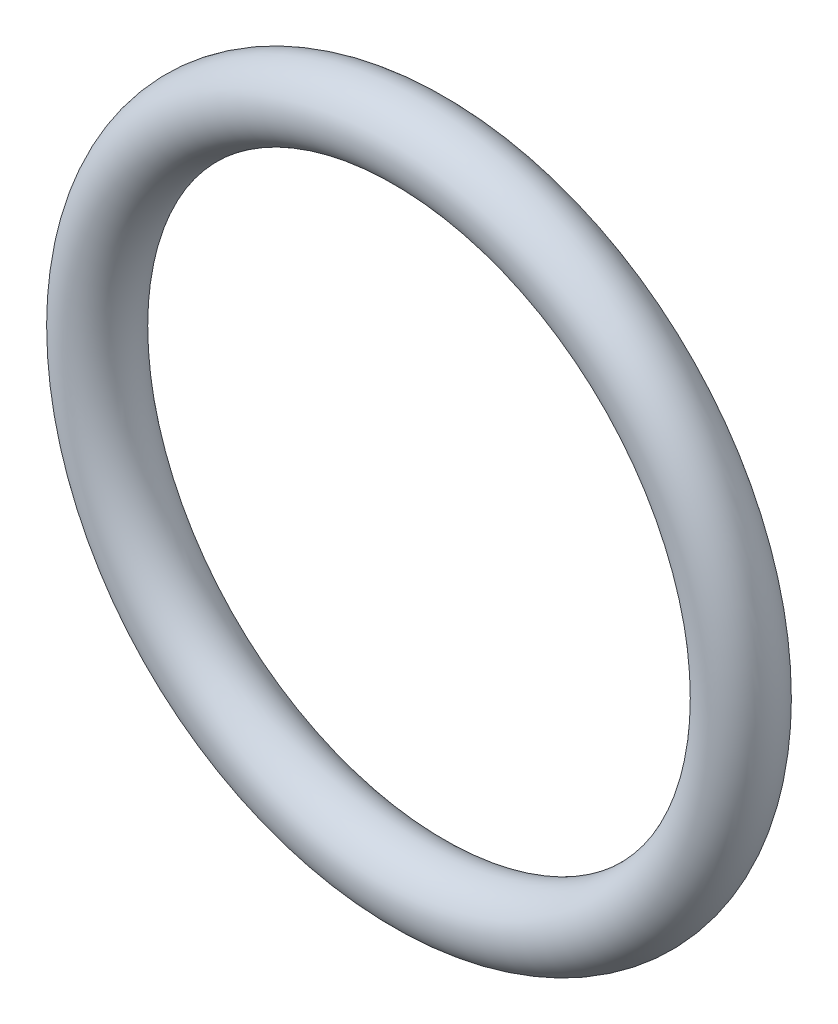
ISO-10303-21;
HEADER;
FILE_DESCRIPTION(('STEP AP214'),'2;1');
FILE_NAME('part.step','',(''),(''),'','','');
FILE_SCHEMA(('AUTOMOTIVE_DESIGN { 1 0 10303 214 1 1 1 1 }'));
ENDSEC;
DATA;
#1=APPLICATION_CONTEXT('core data for automotive mechanical design processes');
#2=APPLICATION_PROTOCOL_DEFINITION('international standard','automotive_design',2000,#1);
#3=PRODUCT_CONTEXT('',#1,'mechanical');
#4=PRODUCT('Part','Part','',(#3));
#5=PRODUCT_RELATED_PRODUCT_CATEGORY('part','',(#4));
#6=PRODUCT_DEFINITION_FORMATION('','',#4);
#7=PRODUCT_DEFINITION_CONTEXT('part definition',#1,'design');
#8=PRODUCT_DEFINITION('design','',#6,#7);
#9=PRODUCT_DEFINITION_SHAPE('','',#8);
#10=(LENGTH_UNIT() NAMED_UNIT(*) SI_UNIT(.MILLI.,.METRE.));
#11=(NAMED_UNIT(*) PLANE_ANGLE_UNIT() SI_UNIT($,.RADIAN.));
#12=(NAMED_UNIT(*) SI_UNIT($,.STERADIAN.) SOLID_ANGLE_UNIT());
#13=UNCERTAINTY_MEASURE_WITH_UNIT(LENGTH_MEASURE(1.E-05),#10,'distance_accuracy_value','');
#14=(GEOMETRIC_REPRESENTATION_CONTEXT(3) GLOBAL_UNCERTAINTY_ASSIGNED_CONTEXT((#13)) GLOBAL_UNIT_ASSIGNED_CONTEXT((#10,
#11,#12)) REPRESENTATION_CONTEXT('',''));
#15=CARTESIAN_POINT('',(0.,0.,0.));
#16=DIRECTION('',(0.,0.,1.));
#17=DIRECTION('',(1.,0.,0.));
#18=AXIS2_PLACEMENT_3D('',#15,#16,#17);
#19=CARTESIAN_POINT('',(0.,0.,0.));
#20=DIRECTION('',(0.,0.,1.));
#21=DIRECTION('',(1.,0.,0.));
#22=AXIS2_PLACEMENT_3D('',#19,#20,#21);
#23=TOROIDAL_SURFACE('',#22,4.5,0.500000000000001);
#24=CARTESIAN_POINT('',(5.,0.,0.));
#25=VERTEX_POINT('',#24);
#26=VERTEX_LOOP('',#25);
#27=FACE_BOUND('',#26,.T.);
#28=ADVANCED_FACE('F31',(#27),#23,.T.);
#29=CLOSED_SHELL('',(#28));
#30=MANIFOLD_SOLID_BREP('B2',#29);
#31=ADVANCED_BREP_SHAPE_REPRESENTATION('',(#18,#30),#14);
#32=SHAPE_DEFINITION_REPRESENTATION(#9,#31);
ENDSEC;
END-ISO-10303-21;
